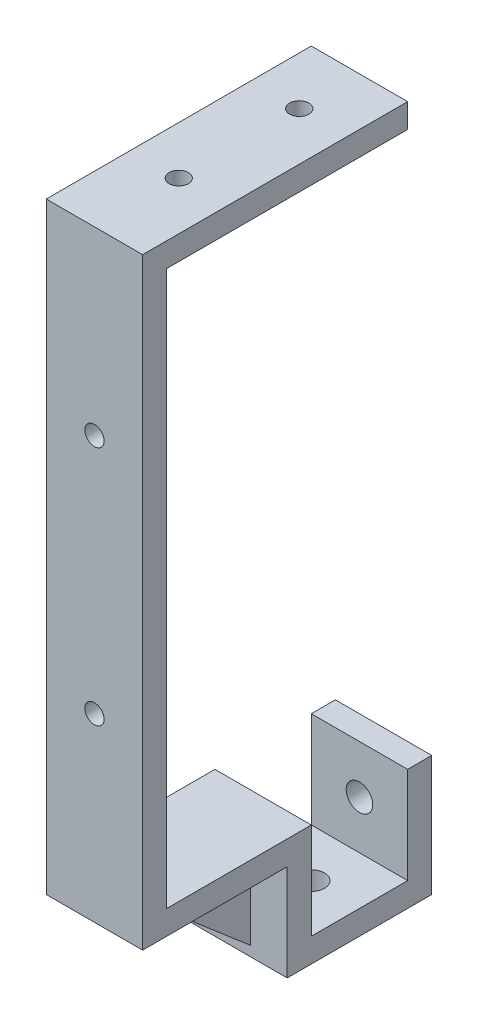
ISO-10303-21;
HEADER;
FILE_DESCRIPTION(('STEP AP214'),'2;1');
FILE_NAME('part.step','',(''),(''),'','','');
FILE_SCHEMA(('AUTOMOTIVE_DESIGN { 1 0 10303 214 1 1 1 1 }'));
ENDSEC;
DATA;
#1=APPLICATION_CONTEXT('core data for automotive mechanical design processes');
#2=APPLICATION_PROTOCOL_DEFINITION('international standard','automotive_design',2000,#1);
#3=PRODUCT_CONTEXT('',#1,'mechanical');
#4=PRODUCT('Part','Part','',(#3));
#5=PRODUCT_RELATED_PRODUCT_CATEGORY('part','',(#4));
#6=PRODUCT_DEFINITION_FORMATION('','',#4);
#7=PRODUCT_DEFINITION_CONTEXT('part definition',#1,'design');
#8=PRODUCT_DEFINITION('design','',#6,#7);
#9=PRODUCT_DEFINITION_SHAPE('','',#8);
#10=(LENGTH_UNIT() NAMED_UNIT(*) SI_UNIT(.MILLI.,.METRE.));
#11=(NAMED_UNIT(*) PLANE_ANGLE_UNIT() SI_UNIT($,.RADIAN.));
#12=(NAMED_UNIT(*) SI_UNIT($,.STERADIAN.) SOLID_ANGLE_UNIT());
#13=UNCERTAINTY_MEASURE_WITH_UNIT(LENGTH_MEASURE(1.E-05),#10,'distance_accuracy_value','');
#14=(GEOMETRIC_REPRESENTATION_CONTEXT(3) GLOBAL_UNCERTAINTY_ASSIGNED_CONTEXT((#13)) GLOBAL_UNIT_ASSIGNED_CONTEXT((#10,
#11,#12)) REPRESENTATION_CONTEXT('',''));
#15=CARTESIAN_POINT('',(0.,0.,0.));
#16=DIRECTION('',(0.,0.,1.));
#17=DIRECTION('',(1.,0.,0.));
#18=AXIS2_PLACEMENT_3D('',#15,#16,#17);
#19=CARTESIAN_POINT('',(-9.82905982905984,-125.128205128205,-55.));
#20=DIRECTION('',(0.,-1.,0.));
#21=DIRECTION('',(0.,0.,-1.));
#22=AXIS2_PLACEMENT_3D('',#19,#20,#21);
#23=PLANE('',#22);
#24=CARTESIAN_POINT('',(0.170940170940168,-125.128205128205,-45.));
#25=DIRECTION('',(0.,1.,0.));
#26=DIRECTION('',(0.,0.,1.));
#27=AXIS2_PLACEMENT_3D('',#24,#25,#26);
#28=CIRCLE('',#27,2.75);
#29=CARTESIAN_POINT('',(0.170940170940168,-125.128205128205,-42.25));
#30=VERTEX_POINT('',#29);
#31=EDGE_CURVE('E170',#30,#30,#28,.T.);
#32=ORIENTED_EDGE('',*,*,#31,.F.);
#33=EDGE_LOOP('',(#32));
#34=FACE_BOUND('',#33,.T.);
#35=DIRECTION('',(1.,0.,0.));
#36=VECTOR('',#35,1.);
#37=CARTESIAN_POINT('',(10.1709401709402,-125.128205128205,-55.));
#38=LINE('',#37,#36);
#39=CARTESIAN_POINT('',(-9.82905982905984,-125.128205128205,-55.));
#40=VERTEX_POINT('',#39);
#41=CARTESIAN_POINT('',(10.1709401709402,-125.128205128205,-55.));
#42=VERTEX_POINT('',#41);
#43=EDGE_CURVE('E187',#40,#42,#38,.T.);
#44=ORIENTED_EDGE('',*,*,#43,.F.);
#45=DIRECTION('',(0.,0.,1.));
#46=VECTOR('',#45,1.);
#47=CARTESIAN_POINT('',(-9.82905982905984,-125.128205128205,-55.));
#48=LINE('',#47,#46);
#49=CARTESIAN_POINT('',(-9.82905982905984,-125.128205128205,-35.));
#50=VERTEX_POINT('',#49);
#51=EDGE_CURVE('E273',#40,#50,#48,.T.);
#52=ORIENTED_EDGE('',*,*,#51,.T.);
#53=DIRECTION('',(1.,0.,0.));
#54=VECTOR('',#53,1.);
#55=CARTESIAN_POINT('',(-9.82905982905984,-125.128205128205,-35.));
#56=LINE('',#55,#54);
#57=CARTESIAN_POINT('',(10.1709401709402,-125.128205128205,-35.));
#58=VERTEX_POINT('',#57);
#59=EDGE_CURVE('E266',#50,#58,#56,.T.);
#60=ORIENTED_EDGE('',*,*,#59,.T.);
#61=DIRECTION('',(0.,0.,1.));
#62=VECTOR('',#61,1.);
#63=CARTESIAN_POINT('',(10.1709401709402,-125.128205128205,-55.));
#64=LINE('',#63,#62);
#65=EDGE_CURVE('E270',#42,#58,#64,.T.);
#66=ORIENTED_EDGE('',*,*,#65,.F.);
#67=EDGE_LOOP('',(#44,#52,#60,#66));
#68=FACE_BOUND('',#67,.T.);
#69=ADVANCED_FACE('F37',(#34,#68),#23,.F.);
#70=CARTESIAN_POINT('',(10.1709401709402,-110.128205128205,-35.));
#71=DIRECTION('',(0.,1.,0.));
#72=DIRECTION('',(0.,0.,1.));
#73=AXIS2_PLACEMENT_3D('',#70,#71,#72);
#74=PLANE('',#73);
#75=DIRECTION('',(-1.,0.,0.));
#76=VECTOR('',#75,1.);
#77=CARTESIAN_POINT('',(10.1709401709402,-110.128205128205,-30.));
#78=LINE('',#77,#76);
#79=CARTESIAN_POINT('',(10.1709401709402,-110.128205128205,-30.));
#80=VERTEX_POINT('',#79);
#81=CARTESIAN_POINT('',(-9.82905982905984,-110.128205128205,-30.));
#82=VERTEX_POINT('',#81);
#83=EDGE_CURVE('E61',#80,#82,#78,.T.);
#84=ORIENTED_EDGE('',*,*,#83,.F.);
#85=DIRECTION('',(0.,0.,1.));
#86=VECTOR('',#85,1.);
#87=CARTESIAN_POINT('',(10.1709401709402,-110.128205128205,-35.));
#88=LINE('',#87,#86);
#89=CARTESIAN_POINT('',(10.1709401709402,-110.128205128205,0.));
#90=VERTEX_POINT('',#89);
#91=EDGE_CURVE('E317',#80,#90,#88,.T.);
#92=ORIENTED_EDGE('',*,*,#91,.T.);
#93=DIRECTION('',(-1.,0.,0.));
#94=VECTOR('',#93,1.);
#95=CARTESIAN_POINT('',(0.,-110.128205128205,0.));
#96=LINE('',#95,#94);
#97=CARTESIAN_POINT('',(-9.82905982905984,-110.128205128205,0.));
#98=VERTEX_POINT('',#97);
#99=EDGE_CURVE('E369',#90,#98,#96,.T.);
#100=ORIENTED_EDGE('',*,*,#99,.T.);
#101=DIRECTION('',(0.,0.,1.));
#102=VECTOR('',#101,1.);
#103=CARTESIAN_POINT('',(-9.82905982905984,-110.128205128205,-35.));
#104=LINE('',#103,#102);
#105=EDGE_CURVE('E314',#82,#98,#104,.T.);
#106=ORIENTED_EDGE('',*,*,#105,.F.);
#107=EDGE_LOOP('',(#84,#92,#100,#106));
#108=FACE_BOUND('',#107,.T.);
#109=DIRECTION('',(0.,0.,1.));
#110=VECTOR('',#109,1.);
#111=CARTESIAN_POINT('',(2.67094017094017,-110.128205128205,-35.));
#112=LINE('',#111,#110);
#113=CARTESIAN_POINT('',(2.67094017094017,-110.128205128205,-29.9291696383079));
#114=VERTEX_POINT('',#113);
#115=CARTESIAN_POINT('',(2.67094017094017,-110.128205128205,-9.07177753676453));
#116=VERTEX_POINT('',#115);
#117=EDGE_CURVE('E11',#114,#116,#112,.T.);
#118=ORIENTED_EDGE('',*,*,#117,.F.);
#119=DIRECTION('',(1.,0.,0.));
#120=VECTOR('',#119,1.);
#121=CARTESIAN_POINT('',(10.1709401709402,-110.128205128205,-29.9291696383079));
#122=LINE('',#121,#120);
#123=CARTESIAN_POINT('',(-2.32905982905983,-110.128205128205,-29.9291696383079));
#124=VERTEX_POINT('',#123);
#125=EDGE_CURVE('E380',#124,#114,#122,.T.);
#126=ORIENTED_EDGE('',*,*,#125,.F.);
#127=DIRECTION('',(0.,0.,1.));
#128=VECTOR('',#127,1.);
#129=CARTESIAN_POINT('',(-2.32905982905983,-110.128205128205,-35.));
#130=LINE('',#129,#128);
#131=CARTESIAN_POINT('',(-2.32905982905983,-110.128205128205,-9.07177753676453));
#132=VERTEX_POINT('',#131);
#133=EDGE_CURVE('E376',#124,#132,#130,.T.);
#134=ORIENTED_EDGE('',*,*,#133,.T.);
#135=DIRECTION('',(-1.,0.,0.));
#136=VECTOR('',#135,1.);
#137=CARTESIAN_POINT('',(10.1709401709402,-110.128205128205,-9.07177753676454));
#138=LINE('',#137,#136);
#139=EDGE_CURVE('E46',#116,#132,#138,.T.);
#140=ORIENTED_EDGE('',*,*,#139,.F.);
#141=EDGE_LOOP('',(#118,#126,#134,#140));
#142=FACE_BOUND('',#141,.T.);
#143=ADVANCED_FACE('F391',(#108,#142),#74,.F.);
#144=CARTESIAN_POINT('',(0.,0.,-35.));
#145=DIRECTION('',(0.,0.,-1.));
#146=DIRECTION('',(-1.,0.,0.));
#147=AXIS2_PLACEMENT_3D('',#144,#145,#146);
#148=PLANE('',#147);
#149=DIRECTION('',(0.,-1.,0.));
#150=VECTOR('',#149,1.);
#151=CARTESIAN_POINT('',(10.1709401709402,-105.128205128205,-35.));
#152=LINE('',#151,#150);
#153=CARTESIAN_POINT('',(10.1709401709402,-105.128205128205,-35.));
#154=VERTEX_POINT('',#153);
#155=EDGE_CURVE('E295',#154,#58,#152,.T.);
#156=ORIENTED_EDGE('',*,*,#155,.T.);
#157=ORIENTED_EDGE('',*,*,#59,.F.);
#158=DIRECTION('',(0.,1.,0.));
#159=VECTOR('',#158,1.);
#160=CARTESIAN_POINT('',(-9.82905982905984,-110.128205128205,-35.));
#161=LINE('',#160,#159);
#162=CARTESIAN_POINT('',(-9.82905982905984,-105.128205128205,-35.));
#163=VERTEX_POINT('',#162);
#164=EDGE_CURVE('E299',#50,#163,#161,.T.);
#165=ORIENTED_EDGE('',*,*,#164,.T.);
#166=DIRECTION('',(1.,0.,0.));
#167=VECTOR('',#166,1.);
#168=CARTESIAN_POINT('',(10.1709401709402,-105.128205128205,-35.));
#169=LINE('',#168,#167);
#170=EDGE_CURVE('E302',#163,#154,#169,.T.);
#171=ORIENTED_EDGE('',*,*,#170,.T.);
#172=EDGE_LOOP('',(#156,#157,#165,#171));
#173=FACE_BOUND('',#172,.T.);
#174=ADVANCED_FACE('F414',(#173),#148,.T.);
#175=CARTESIAN_POINT('',(0.,0.,-5.));
#176=DIRECTION('',(0.,0.,1.));
#177=DIRECTION('',(1.,0.,0.));
#178=AXIS2_PLACEMENT_3D('',#175,#176,#177);
#179=PLANE('',#178);
#180=CARTESIAN_POINT('',(0.170940170940166,-22.6282051282051,-5.));
#181=DIRECTION('',(0.,0.,-1.));
#182=DIRECTION('',(-1.,0.,0.));
#183=AXIS2_PLACEMENT_3D('',#180,#181,#182);
#184=CIRCLE('',#183,2.);
#185=CARTESIAN_POINT('',(-1.82905982905983,-22.6282051282051,-5.));
#186=VERTEX_POINT('',#185);
#187=EDGE_CURVE('E223',#186,#186,#184,.T.);
#188=ORIENTED_EDGE('',*,*,#187,.F.);
#189=EDGE_LOOP('',(#188));
#190=FACE_BOUND('',#189,.T.);
#191=CARTESIAN_POINT('',(0.170940170940166,-72.6282051282051,-5.));
#192=DIRECTION('',(0.,0.,-1.));
#193=DIRECTION('',(-1.,0.,0.));
#194=AXIS2_PLACEMENT_3D('',#191,#192,#193);
#195=CIRCLE('',#194,2.);
#196=CARTESIAN_POINT('',(-1.82905982905983,-72.6282051282051,-5.));
#197=VERTEX_POINT('',#196);
#198=EDGE_CURVE('E214',#197,#197,#195,.T.);
#199=ORIENTED_EDGE('',*,*,#198,.F.);
#200=EDGE_LOOP('',(#199));
#201=FACE_BOUND('',#200,.T.);
#202=DIRECTION('',(1.,0.,0.));
#203=VECTOR('',#202,1.);
#204=CARTESIAN_POINT('',(10.1709401709402,-105.128205128205,-5.));
#205=LINE('',#204,#203);
#206=CARTESIAN_POINT('',(-9.82905982905984,-105.128205128205,-5.));
#207=VERTEX_POINT('',#206);
#208=CARTESIAN_POINT('',(10.1709401709402,-105.128205128205,-5.));
#209=VERTEX_POINT('',#208);
#210=EDGE_CURVE('E294',#207,#209,#205,.T.);
#211=ORIENTED_EDGE('',*,*,#210,.F.);
#212=DIRECTION('',(0.,-1.,0.));
#213=VECTOR('',#212,1.);
#214=CARTESIAN_POINT('',(-9.82905982905984,14.8717948717949,-5.));
#215=LINE('',#214,#213);
#216=CARTESIAN_POINT('',(-9.82905982905984,9.87179487179487,-5.));
#217=VERTEX_POINT('',#216);
#218=EDGE_CURVE('E348',#217,#207,#215,.T.);
#219=ORIENTED_EDGE('',*,*,#218,.F.);
#220=DIRECTION('',(-1.,0.,0.));
#221=VECTOR('',#220,1.);
#222=CARTESIAN_POINT('',(10.1709401709402,9.87179487179488,-5.));
#223=LINE('',#222,#221);
#224=CARTESIAN_POINT('',(10.1709401709402,9.87179487179487,-5.));
#225=VERTEX_POINT('',#224);
#226=EDGE_CURVE('E320',#225,#217,#223,.T.);
#227=ORIENTED_EDGE('',*,*,#226,.F.);
#228=DIRECTION('',(0.,1.,0.));
#229=VECTOR('',#228,1.);
#230=CARTESIAN_POINT('',(10.1709401709402,14.8717948717949,-5.));
#231=LINE('',#230,#229);
#232=EDGE_CURVE('E352',#209,#225,#231,.T.);
#233=ORIENTED_EDGE('',*,*,#232,.F.);
#234=EDGE_LOOP('',(#211,#219,#227,#233));
#235=FACE_BOUND('',#234,.T.);
#236=ADVANCED_FACE('F431',(#190,#201,#235),#179,.F.);
#237=CARTESIAN_POINT('',(-9.82905982905984,14.8717948717949,-5.));
#238=DIRECTION('',(-1.,0.,0.));
#239=DIRECTION('',(0.,-1.,0.));
#240=AXIS2_PLACEMENT_3D('',#237,#238,#239);
#241=PLANE('',#240);
#242=ORIENTED_EDGE('',*,*,#164,.F.);
#243=ORIENTED_EDGE('',*,*,#51,.F.);
#244=DIRECTION('',(0.,-1.,0.));
#245=VECTOR('',#244,1.);
#246=CARTESIAN_POINT('',(-9.82905982905984,-105.128205128205,-55.));
#247=LINE('',#246,#245);
#248=CARTESIAN_POINT('',(-9.82905982905984,-105.128205128205,-55.));
#249=VERTEX_POINT('',#248);
#250=EDGE_CURVE('E202',#249,#40,#247,.T.);
#251=ORIENTED_EDGE('',*,*,#250,.F.);
#252=DIRECTION('',(0.,0.,1.));
#253=VECTOR('',#252,1.);
#254=CARTESIAN_POINT('',(-9.82905982905984,-105.128205128205,-60.));
#255=LINE('',#254,#253);
#256=CARTESIAN_POINT('',(-9.82905982905984,-105.128205128205,-60.));
#257=VERTEX_POINT('',#256);
#258=EDGE_CURVE('E180',#257,#249,#255,.T.);
#259=ORIENTED_EDGE('',*,*,#258,.F.);
#260=DIRECTION('',(0.,1.,0.));
#261=VECTOR('',#260,1.);
#262=CARTESIAN_POINT('',(-9.82905982905984,-130.128205128205,-60.));
#263=LINE('',#262,#261);
#264=CARTESIAN_POINT('',(-9.82905982905984,-130.128205128205,-60.));
#265=VERTEX_POINT('',#264);
#266=EDGE_CURVE('E171',#265,#257,#263,.T.);
#267=ORIENTED_EDGE('',*,*,#266,.F.);
#268=DIRECTION('',(0.,0.,-1.));
#269=VECTOR('',#268,1.);
#270=CARTESIAN_POINT('',(-9.82905982905984,-130.128205128205,-35.));
#271=LINE('',#270,#269);
#272=CARTESIAN_POINT('',(-9.82905982905984,-130.128205128205,-30.));
#273=VERTEX_POINT('',#272);
#274=EDGE_CURVE('E281',#273,#265,#271,.T.);
#275=ORIENTED_EDGE('',*,*,#274,.F.);
#276=DIRECTION('',(0.,1.,0.));
#277=VECTOR('',#276,1.);
#278=CARTESIAN_POINT('',(-9.82905982905984,-130.128205128205,-30.));
#279=LINE('',#278,#277);
#280=EDGE_CURVE('E284',#273,#82,#279,.T.);
#281=ORIENTED_EDGE('',*,*,#280,.T.);
#282=ORIENTED_EDGE('',*,*,#105,.T.);
#283=DIRECTION('',(0.,-1.,0.));
#284=VECTOR('',#283,1.);
#285=CARTESIAN_POINT('',(-9.82905982905984,14.8717948717949,0.));
#286=LINE('',#285,#284);
#287=CARTESIAN_POINT('',(-9.82905982905984,14.8717948717949,0.));
#288=VERTEX_POINT('',#287);
#289=EDGE_CURVE('E347',#288,#98,#286,.T.);
#290=ORIENTED_EDGE('',*,*,#289,.F.);
#291=DIRECTION('',(0.,0.,1.));
#292=VECTOR('',#291,1.);
#293=CARTESIAN_POINT('',(-9.82905982905984,14.8717948717949,-5.));
#294=LINE('',#293,#292);
#295=CARTESIAN_POINT('',(-9.82905982905984,14.8717948717949,-55.));
#296=VERTEX_POINT('',#295);
#297=EDGE_CURVE('E366',#296,#288,#294,.T.);
#298=ORIENTED_EDGE('',*,*,#297,.F.);
#299=DIRECTION('',(0.,1.,0.));
#300=VECTOR('',#299,1.);
#301=CARTESIAN_POINT('',(-9.82905982905984,14.8717948717949,-55.));
#302=LINE('',#301,#300);
#303=CARTESIAN_POINT('',(-9.82905982905984,9.87179487179487,-55.));
#304=VERTEX_POINT('',#303);
#305=EDGE_CURVE('E328',#304,#296,#302,.T.);
#306=ORIENTED_EDGE('',*,*,#305,.F.);
#307=DIRECTION('',(0.,0.,1.));
#308=VECTOR('',#307,1.);
#309=CARTESIAN_POINT('',(-9.82905982905984,9.87179487179487,-55.));
#310=LINE('',#309,#308);
#311=EDGE_CURVE('E336',#304,#217,#310,.T.);
#312=ORIENTED_EDGE('',*,*,#311,.T.);
#313=ORIENTED_EDGE('',*,*,#218,.T.);
#314=DIRECTION('',(0.,0.,1.));
#315=VECTOR('',#314,1.);
#316=CARTESIAN_POINT('',(-9.82905982905984,-105.128205128205,-35.));
#317=LINE('',#316,#315);
#318=EDGE_CURVE('E311',#163,#207,#317,.T.);
#319=ORIENTED_EDGE('',*,*,#318,.F.);
#320=EDGE_LOOP('',(#242,#243,#251,#259,#267,#275,#281,#282,#290,#298,#306,#312,#313,#319));
#321=FACE_BOUND('',#320,.T.);
#322=ADVANCED_FACE('F39',(#321),#241,.T.);
#323=CARTESIAN_POINT('',(-9.82905982905984,14.8717948717949,-5.));
#324=DIRECTION('',(0.,1.,0.));
#325=DIRECTION('',(0.,0.,1.));
#326=AXIS2_PLACEMENT_3D('',#323,#324,#325);
#327=PLANE('',#326);
#328=CARTESIAN_POINT('',(0.170940170940157,14.8717948717949,-17.5));
#329=DIRECTION('',(0.,-1.,0.));
#330=DIRECTION('',(1.,0.,0.));
#331=AXIS2_PLACEMENT_3D('',#328,#329,#330);
#332=CIRCLE('',#331,2.);
#333=CARTESIAN_POINT('',(2.17094017094016,14.8717948717949,-17.5));
#334=VERTEX_POINT('',#333);
#335=EDGE_CURVE('E234',#334,#334,#332,.T.);
#336=ORIENTED_EDGE('',*,*,#335,.T.);
#337=EDGE_LOOP('',(#336));
#338=FACE_BOUND('',#337,.T.);
#339=CARTESIAN_POINT('',(0.170940170940164,14.8717948717949,-42.5));
#340=DIRECTION('',(0.,-1.,0.));
#341=DIRECTION('',(1.,0.,0.));
#342=AXIS2_PLACEMENT_3D('',#339,#340,#341);
#343=CIRCLE('',#342,2.);
#344=CARTESIAN_POINT('',(2.17094017094016,14.8717948717949,-42.5));
#345=VERTEX_POINT('',#344);
#346=EDGE_CURVE('E242',#345,#345,#343,.T.);
#347=ORIENTED_EDGE('',*,*,#346,.T.);
#348=EDGE_LOOP('',(#347));
#349=FACE_BOUND('',#348,.T.);
#350=DIRECTION('',(-1.,0.,0.));
#351=VECTOR('',#350,1.);
#352=CARTESIAN_POINT('',(-9.82905982905984,14.8717948717949,0.));
#353=LINE('',#352,#351);
#354=CARTESIAN_POINT('',(10.1709401709402,14.8717948717949,0.));
#355=VERTEX_POINT('',#354);
#356=EDGE_CURVE('E353',#355,#288,#353,.T.);
#357=ORIENTED_EDGE('',*,*,#356,.F.);
#358=DIRECTION('',(0.,0.,1.));
#359=VECTOR('',#358,1.);
#360=CARTESIAN_POINT('',(10.1709401709402,14.8717948717949,-5.));
#361=LINE('',#360,#359);
#362=CARTESIAN_POINT('',(10.1709401709402,14.8717948717949,-55.));
#363=VERTEX_POINT('',#362);
#364=EDGE_CURVE('E356',#363,#355,#361,.T.);
#365=ORIENTED_EDGE('',*,*,#364,.F.);
#366=DIRECTION('',(1.,0.,0.));
#367=VECTOR('',#366,1.);
#368=CARTESIAN_POINT('',(10.1709401709402,14.8717948717949,-55.));
#369=LINE('',#368,#367);
#370=EDGE_CURVE('E332',#296,#363,#369,.T.);
#371=ORIENTED_EDGE('',*,*,#370,.F.);
#372=ORIENTED_EDGE('',*,*,#297,.T.);
#373=EDGE_LOOP('',(#357,#365,#371,#372));
#374=FACE_BOUND('',#373,.T.);
#375=ADVANCED_FACE('F451',(#338,#349,#374),#327,.T.);
#376=CARTESIAN_POINT('',(10.1709401709402,14.8717948717949,-5.));
#377=DIRECTION('',(1.,0.,0.));
#378=DIRECTION('',(0.,1.,0.));
#379=AXIS2_PLACEMENT_3D('',#376,#377,#378);
#380=PLANE('',#379);
#381=DIRECTION('',(0.,1.,0.));
#382=VECTOR('',#381,1.);
#383=CARTESIAN_POINT('',(10.1709401709402,14.8717948717949,0.));
#384=LINE('',#383,#382);
#385=EDGE_CURVE('E360',#90,#355,#384,.T.);
#386=ORIENTED_EDGE('',*,*,#385,.F.);
#387=ORIENTED_EDGE('',*,*,#91,.F.);
#388=DIRECTION('',(0.,1.,0.));
#389=VECTOR('',#388,1.);
#390=CARTESIAN_POINT('',(10.1709401709402,-130.128205128205,-30.));
#391=LINE('',#390,#389);
#392=CARTESIAN_POINT('',(10.1709401709402,-130.128205128205,-30.));
#393=VERTEX_POINT('',#392);
#394=EDGE_CURVE('E290',#393,#80,#391,.T.);
#395=ORIENTED_EDGE('',*,*,#394,.F.);
#396=DIRECTION('',(0.,0.,1.));
#397=VECTOR('',#396,1.);
#398=CARTESIAN_POINT('',(10.1709401709402,-130.128205128205,-30.));
#399=LINE('',#398,#397);
#400=CARTESIAN_POINT('',(10.1709401709402,-130.128205128205,-60.));
#401=VERTEX_POINT('',#400);
#402=EDGE_CURVE('E165',#401,#393,#399,.T.);
#403=ORIENTED_EDGE('',*,*,#402,.F.);
#404=DIRECTION('',(0.,-1.,0.));
#405=VECTOR('',#404,1.);
#406=CARTESIAN_POINT('',(10.1709401709402,-125.128205128205,-60.));
#407=LINE('',#406,#405);
#408=CARTESIAN_POINT('',(10.1709401709402,-105.128205128205,-60.));
#409=VERTEX_POINT('',#408);
#410=EDGE_CURVE('E156',#409,#401,#407,.T.);
#411=ORIENTED_EDGE('',*,*,#410,.F.);
#412=DIRECTION('',(0.,0.,-1.));
#413=VECTOR('',#412,1.);
#414=CARTESIAN_POINT('',(10.1709401709402,-105.128205128205,-55.));
#415=LINE('',#414,#413);
#416=CARTESIAN_POINT('',(10.1709401709402,-105.128205128205,-55.));
#417=VERTEX_POINT('',#416);
#418=EDGE_CURVE('E162',#417,#409,#415,.T.);
#419=ORIENTED_EDGE('',*,*,#418,.F.);
#420=DIRECTION('',(0.,-1.,0.));
#421=VECTOR('',#420,1.);
#422=CARTESIAN_POINT('',(10.1709401709402,-105.128205128205,-55.));
#423=LINE('',#422,#421);
#424=EDGE_CURVE('E198',#417,#42,#423,.T.);
#425=ORIENTED_EDGE('',*,*,#424,.T.);
#426=ORIENTED_EDGE('',*,*,#65,.T.);
#427=ORIENTED_EDGE('',*,*,#155,.F.);
#428=DIRECTION('',(0.,0.,1.));
#429=VECTOR('',#428,1.);
#430=CARTESIAN_POINT('',(10.1709401709402,-105.128205128205,-35.));
#431=LINE('',#430,#429);
#432=EDGE_CURVE('E305',#154,#209,#431,.T.);
#433=ORIENTED_EDGE('',*,*,#432,.T.);
#434=ORIENTED_EDGE('',*,*,#232,.T.);
#435=DIRECTION('',(0.,0.,1.));
#436=VECTOR('',#435,1.);
#437=CARTESIAN_POINT('',(10.1709401709402,9.87179487179488,-55.));
#438=LINE('',#437,#436);
#439=CARTESIAN_POINT('',(10.1709401709402,9.87179487179488,-55.));
#440=VERTEX_POINT('',#439);
#441=EDGE_CURVE('E343',#440,#225,#438,.T.);
#442=ORIENTED_EDGE('',*,*,#441,.F.);
#443=DIRECTION('',(0.,-1.,0.));
#444=VECTOR('',#443,1.);
#445=CARTESIAN_POINT('',(10.1709401709402,9.87179487179488,-55.));
#446=LINE('',#445,#444);
#447=EDGE_CURVE('E321',#363,#440,#446,.T.);
#448=ORIENTED_EDGE('',*,*,#447,.F.);
#449=ORIENTED_EDGE('',*,*,#364,.T.);
#450=EDGE_LOOP('',(#386,#387,#395,#403,#411,#419,#425,#426,#427,#433,#434,#442,#448,#449));
#451=FACE_BOUND('',#450,.T.);
#452=ADVANCED_FACE('F159',(#451),#380,.T.);
#453=CARTESIAN_POINT('',(0.,0.,0.));
#454=DIRECTION('',(0.,0.,1.));
#455=DIRECTION('',(1.,0.,0.));
#456=AXIS2_PLACEMENT_3D('',#453,#454,#455);
#457=PLANE('',#456);
#458=CARTESIAN_POINT('',(0.170940170940166,-22.6282051282051,0.));
#459=DIRECTION('',(0.,0.,-1.));
#460=DIRECTION('',(-1.,0.,0.));
#461=AXIS2_PLACEMENT_3D('',#458,#459,#460);
#462=CIRCLE('',#461,2.);
#463=CARTESIAN_POINT('',(-1.82905982905983,-22.6282051282051,0.));
#464=VERTEX_POINT('',#463);
#465=EDGE_CURVE('E218',#464,#464,#462,.T.);
#466=ORIENTED_EDGE('',*,*,#465,.T.);
#467=EDGE_LOOP('',(#466));
#468=FACE_BOUND('',#467,.T.);
#469=CARTESIAN_POINT('',(0.170940170940166,-72.6282051282051,0.));
#470=DIRECTION('',(0.,0.,-1.));
#471=DIRECTION('',(-1.,0.,0.));
#472=AXIS2_PLACEMENT_3D('',#469,#470,#471);
#473=CIRCLE('',#472,2.);
#474=CARTESIAN_POINT('',(-1.82905982905983,-72.6282051282051,0.));
#475=VERTEX_POINT('',#474);
#476=EDGE_CURVE('E227',#475,#475,#473,.T.);
#477=ORIENTED_EDGE('',*,*,#476,.T.);
#478=EDGE_LOOP('',(#477));
#479=FACE_BOUND('',#478,.T.);
#480=ORIENTED_EDGE('',*,*,#99,.F.);
#481=ORIENTED_EDGE('',*,*,#385,.T.);
#482=ORIENTED_EDGE('',*,*,#356,.T.);
#483=ORIENTED_EDGE('',*,*,#289,.T.);
#484=EDGE_LOOP('',(#480,#481,#482,#483));
#485=FACE_BOUND('',#484,.T.);
#486=ADVANCED_FACE('F443',(#468,#479,#485),#457,.T.);
#487=CARTESIAN_POINT('',(10.1709401709402,9.87179487179488,-55.));
#488=DIRECTION('',(0.,1.,0.));
#489=DIRECTION('',(-1.,0.,0.));
#490=AXIS2_PLACEMENT_3D('',#487,#488,#489);
#491=PLANE('',#490);
#492=CARTESIAN_POINT('',(0.170940170940159,9.87179487179487,-17.5));
#493=DIRECTION('',(0.,-1.,0.));
#494=DIRECTION('',(1.,0.,0.));
#495=AXIS2_PLACEMENT_3D('',#492,#493,#494);
#496=CIRCLE('',#495,2.);
#497=CARTESIAN_POINT('',(2.17094017094016,9.87179487179487,-17.5));
#498=VERTEX_POINT('',#497);
#499=EDGE_CURVE('E238',#498,#498,#496,.T.);
#500=ORIENTED_EDGE('',*,*,#499,.F.);
#501=EDGE_LOOP('',(#500));
#502=FACE_BOUND('',#501,.T.);
#503=CARTESIAN_POINT('',(0.170940170940166,9.87179487179487,-42.5));
#504=DIRECTION('',(0.,-1.,0.));
#505=DIRECTION('',(1.,0.,0.));
#506=AXIS2_PLACEMENT_3D('',#503,#504,#505);
#507=CIRCLE('',#506,2.);
#508=CARTESIAN_POINT('',(2.17094017094017,9.87179487179487,-42.5));
#509=VERTEX_POINT('',#508);
#510=EDGE_CURVE('E222',#509,#509,#507,.T.);
#511=ORIENTED_EDGE('',*,*,#510,.F.);
#512=EDGE_LOOP('',(#511));
#513=FACE_BOUND('',#512,.T.);
#514=ORIENTED_EDGE('',*,*,#226,.T.);
#515=ORIENTED_EDGE('',*,*,#311,.F.);
#516=DIRECTION('',(-1.,0.,0.));
#517=VECTOR('',#516,1.);
#518=CARTESIAN_POINT('',(10.1709401709402,9.87179487179488,-55.));
#519=LINE('',#518,#517);
#520=EDGE_CURVE('E325',#440,#304,#519,.T.);
#521=ORIENTED_EDGE('',*,*,#520,.F.);
#522=ORIENTED_EDGE('',*,*,#441,.T.);
#523=EDGE_LOOP('',(#514,#515,#521,#522));
#524=FACE_BOUND('',#523,.T.);
#525=ADVANCED_FACE('F439',(#502,#513,#524),#491,.F.);
#526=CARTESIAN_POINT('',(0.,0.,-55.));
#527=DIRECTION('',(0.,0.,1.));
#528=DIRECTION('',(1.,0.,0.));
#529=AXIS2_PLACEMENT_3D('',#526,#527,#528);
#530=PLANE('',#529);
#531=ORIENTED_EDGE('',*,*,#447,.T.);
#532=ORIENTED_EDGE('',*,*,#520,.T.);
#533=ORIENTED_EDGE('',*,*,#305,.T.);
#534=ORIENTED_EDGE('',*,*,#370,.T.);
#535=EDGE_LOOP('',(#531,#532,#533,#534));
#536=FACE_BOUND('',#535,.T.);
#537=ADVANCED_FACE('F434',(#536),#530,.F.);
#538=CARTESIAN_POINT('',(10.1709401709402,-105.128205128205,-35.));
#539=DIRECTION('',(0.,-1.,0.));
#540=DIRECTION('',(0.,0.,-1.));
#541=AXIS2_PLACEMENT_3D('',#538,#539,#540);
#542=PLANE('',#541);
#543=ORIENTED_EDGE('',*,*,#210,.T.);
#544=ORIENTED_EDGE('',*,*,#432,.F.);
#545=ORIENTED_EDGE('',*,*,#170,.F.);
#546=ORIENTED_EDGE('',*,*,#318,.T.);
#547=EDGE_LOOP('',(#543,#544,#545,#546));
#548=FACE_BOUND('',#547,.T.);
#549=ADVANCED_FACE('F427',(#548),#542,.F.);
#550=CARTESIAN_POINT('',(10.1709401709402,-130.128205128205,-30.));
#551=DIRECTION('',(0.,0.,-1.));
#552=DIRECTION('',(-1.,0.,0.));
#553=AXIS2_PLACEMENT_3D('',#550,#551,#552);
#554=PLANE('',#553);
#555=ORIENTED_EDGE('',*,*,#83,.T.);
#556=ORIENTED_EDGE('',*,*,#280,.F.);
#557=DIRECTION('',(-1.,0.,0.));
#558=VECTOR('',#557,1.);
#559=CARTESIAN_POINT('',(10.1709401709402,-130.128205128205,-30.));
#560=LINE('',#559,#558);
#561=EDGE_CURVE('E278',#393,#273,#560,.T.);
#562=ORIENTED_EDGE('',*,*,#561,.F.);
#563=ORIENTED_EDGE('',*,*,#394,.T.);
#564=EDGE_LOOP('',(#555,#556,#562,#563));
#565=FACE_BOUND('',#564,.T.);
#566=ADVANCED_FACE('F423',(#565),#554,.F.);
#567=CARTESIAN_POINT('',(0.,-130.128205128205,0.));
#568=DIRECTION('',(0.,1.,0.));
#569=DIRECTION('',(0.,0.,1.));
#570=AXIS2_PLACEMENT_3D('',#567,#568,#569);
#571=PLANE('',#570);
#572=CARTESIAN_POINT('',(0.170940170940168,-130.128205128205,-45.));
#573=DIRECTION('',(0.,1.,0.));
#574=DIRECTION('',(0.,0.,1.));
#575=AXIS2_PLACEMENT_3D('',#572,#573,#574);
#576=CIRCLE('',#575,2.75);
#577=CARTESIAN_POINT('',(0.170940170940168,-130.128205128205,-42.25));
#578=VERTEX_POINT('',#577);
#579=EDGE_CURVE('E210',#578,#578,#576,.T.);
#580=ORIENTED_EDGE('',*,*,#579,.T.);
#581=EDGE_LOOP('',(#580));
#582=FACE_BOUND('',#581,.T.);
#583=ORIENTED_EDGE('',*,*,#402,.T.);
#584=ORIENTED_EDGE('',*,*,#561,.T.);
#585=ORIENTED_EDGE('',*,*,#274,.T.);
#586=DIRECTION('',(-1.,0.,0.));
#587=VECTOR('',#586,1.);
#588=CARTESIAN_POINT('',(10.1709401709402,-130.128205128205,-60.));
#589=LINE('',#588,#587);
#590=EDGE_CURVE('E205',#401,#265,#589,.T.);
#591=ORIENTED_EDGE('',*,*,#590,.F.);
#592=EDGE_LOOP('',(#583,#584,#585,#591));
#593=FACE_BOUND('',#592,.T.);
#594=ADVANCED_FACE('F420',(#582,#593),#571,.F.);
#595=CARTESIAN_POINT('',(2.67094017094017,-110.036991645757,-8.9652738327004));
#596=DIRECTION('',(0.,0.759522254265013,-0.650481318160785));
#597=DIRECTION('',(0.,0.650481318160785,0.759522254265013));
#598=AXIS2_PLACEMENT_3D('',#595,#596,#597);
#599=PLANE('',#598);
#600=DIRECTION('',(0.,-0.650481318160785,-0.759522254265013));
#601=VECTOR('',#600,1.);
#602=CARTESIAN_POINT('',(2.67094017094017,-110.036991645757,-8.9652738327004));
#603=LINE('',#602,#601);
#604=CARTESIAN_POINT('',(2.67094017094017,-127.991202336545,-29.9291696383079));
#605=VERTEX_POINT('',#604);
#606=EDGE_CURVE('E249',#116,#605,#603,.T.);
#607=ORIENTED_EDGE('',*,*,#606,.F.);
#608=ORIENTED_EDGE('',*,*,#139,.T.);
#609=DIRECTION('',(0.,-0.650481318160785,-0.759522254265013));
#610=VECTOR('',#609,1.);
#611=CARTESIAN_POINT('',(-2.32905982905983,-110.036991645757,-8.9652738327004));
#612=LINE('',#611,#610);
#613=CARTESIAN_POINT('',(-2.32905982905983,-127.991202336545,-29.9291696383079));
#614=VERTEX_POINT('',#613);
#615=EDGE_CURVE('E53',#132,#614,#612,.T.);
#616=ORIENTED_EDGE('',*,*,#615,.T.);
#617=DIRECTION('',(-1.,0.,0.));
#618=VECTOR('',#617,1.);
#619=CARTESIAN_POINT('',(2.67094017094017,-127.991202336545,-29.9291696383079));
#620=LINE('',#619,#618);
#621=EDGE_CURVE('E257',#605,#614,#620,.T.);
#622=ORIENTED_EDGE('',*,*,#621,.F.);
#623=EDGE_LOOP('',(#607,#608,#616,#622));
#624=FACE_BOUND('',#623,.T.);
#625=ADVANCED_FACE('F386',(#624),#599,.F.);
#626=CARTESIAN_POINT('',(2.67094017094017,-127.991202336545,-29.9291696383079));
#627=DIRECTION('',(0.,0.,1.));
#628=DIRECTION('',(1.,0.,0.));
#629=AXIS2_PLACEMENT_3D('',#626,#627,#628);
#630=PLANE('',#629);
#631=DIRECTION('',(0.,1.,0.));
#632=VECTOR('',#631,1.);
#633=CARTESIAN_POINT('',(-2.32905982905983,-127.991202336545,-29.9291696383079));
#634=LINE('',#633,#632);
#635=EDGE_CURVE('E253',#614,#124,#634,.T.);
#636=ORIENTED_EDGE('',*,*,#635,.T.);
#637=ORIENTED_EDGE('',*,*,#125,.T.);
#638=DIRECTION('',(0.,1.,0.));
#639=VECTOR('',#638,1.);
#640=CARTESIAN_POINT('',(2.67094017094017,-127.991202336545,-29.9291696383079));
#641=LINE('',#640,#639);
#642=EDGE_CURVE('E252',#605,#114,#641,.T.);
#643=ORIENTED_EDGE('',*,*,#642,.F.);
#644=ORIENTED_EDGE('',*,*,#621,.T.);
#645=EDGE_LOOP('',(#636,#637,#643,#644));
#646=FACE_BOUND('',#645,.T.);
#647=ADVANCED_FACE('F394',(#646),#630,.F.);
#648=CARTESIAN_POINT('',(2.67094017094016,0.,0.));
#649=DIRECTION('',(-1.,0.,0.));
#650=DIRECTION('',(0.,-1.,0.));
#651=AXIS2_PLACEMENT_3D('',#648,#649,#650);
#652=PLANE('',#651);
#653=ORIENTED_EDGE('',*,*,#642,.T.);
#654=ORIENTED_EDGE('',*,*,#117,.T.);
#655=ORIENTED_EDGE('',*,*,#606,.T.);
#656=EDGE_LOOP('',(#653,#654,#655));
#657=FACE_BOUND('',#656,.T.);
#658=ADVANCED_FACE('F397',(#657),#652,.F.);
#659=CARTESIAN_POINT('',(-2.32905982905984,0.,0.));
#660=DIRECTION('',(-1.,0.,0.));
#661=DIRECTION('',(0.,-1.,0.));
#662=AXIS2_PLACEMENT_3D('',#659,#660,#661);
#663=PLANE('',#662);
#664=ORIENTED_EDGE('',*,*,#133,.F.);
#665=ORIENTED_EDGE('',*,*,#635,.F.);
#666=ORIENTED_EDGE('',*,*,#615,.F.);
#667=EDGE_LOOP('',(#664,#665,#666));
#668=FACE_BOUND('',#667,.T.);
#669=ADVANCED_FACE('F392',(#668),#663,.T.);
#670=CARTESIAN_POINT('',(0.170940170940164,14.8717948717949,-42.5));
#671=DIRECTION('',(0.,-1.,0.));
#672=DIRECTION('',(1.,0.,0.));
#673=AXIS2_PLACEMENT_3D('',#670,#671,#672);
#674=CYLINDRICAL_SURFACE('',#673,2.);
#675=ORIENTED_EDGE('',*,*,#346,.F.);
#676=EDGE_LOOP('',(#675));
#677=FACE_BOUND('',#676,.T.);
#678=ORIENTED_EDGE('',*,*,#510,.T.);
#679=EDGE_LOOP('',(#678));
#680=FACE_BOUND('',#679,.T.);
#681=ADVANCED_FACE('F404',(#677,#680),#674,.F.);
#682=CARTESIAN_POINT('',(0.170940170940157,14.8717948717949,-17.5));
#683=DIRECTION('',(0.,-1.,0.));
#684=DIRECTION('',(1.,0.,0.));
#685=AXIS2_PLACEMENT_3D('',#682,#683,#684);
#686=CYLINDRICAL_SURFACE('',#685,2.);
#687=ORIENTED_EDGE('',*,*,#335,.F.);
#688=EDGE_LOOP('',(#687));
#689=FACE_BOUND('',#688,.T.);
#690=ORIENTED_EDGE('',*,*,#499,.T.);
#691=EDGE_LOOP('',(#690));
#692=FACE_BOUND('',#691,.T.);
#693=ADVANCED_FACE('F648',(#689,#692),#686,.F.);
#694=CARTESIAN_POINT('',(0.170940170940166,-72.6282051282051,0.));
#695=DIRECTION('',(0.,0.,-1.));
#696=DIRECTION('',(-1.,0.,0.));
#697=AXIS2_PLACEMENT_3D('',#694,#695,#696);
#698=CYLINDRICAL_SURFACE('',#697,2.);
#699=ORIENTED_EDGE('',*,*,#476,.F.);
#700=EDGE_LOOP('',(#699));
#701=FACE_BOUND('',#700,.T.);
#702=ORIENTED_EDGE('',*,*,#198,.T.);
#703=EDGE_LOOP('',(#702));
#704=FACE_BOUND('',#703,.T.);
#705=ADVANCED_FACE('F640',(#701,#704),#698,.F.);
#706=CARTESIAN_POINT('',(0.170940170940166,-22.6282051282051,0.));
#707=DIRECTION('',(0.,0.,-1.));
#708=DIRECTION('',(-1.,0.,0.));
#709=AXIS2_PLACEMENT_3D('',#706,#707,#708);
#710=CYLINDRICAL_SURFACE('',#709,2.);
#711=ORIENTED_EDGE('',*,*,#465,.F.);
#712=EDGE_LOOP('',(#711));
#713=FACE_BOUND('',#712,.T.);
#714=ORIENTED_EDGE('',*,*,#187,.T.);
#715=EDGE_LOOP('',(#714));
#716=FACE_BOUND('',#715,.T.);
#717=ADVANCED_FACE('F631',(#713,#716),#710,.F.);
#718=CARTESIAN_POINT('',(0.170940170940168,-130.128205128205,-45.));
#719=DIRECTION('',(0.,1.,0.));
#720=DIRECTION('',(0.,0.,1.));
#721=AXIS2_PLACEMENT_3D('',#718,#719,#720);
#722=CYLINDRICAL_SURFACE('',#721,2.75);
#723=ORIENTED_EDGE('',*,*,#579,.F.);
#724=EDGE_LOOP('',(#723));
#725=FACE_BOUND('',#724,.T.);
#726=ORIENTED_EDGE('',*,*,#31,.T.);
#727=EDGE_LOOP('',(#726));
#728=FACE_BOUND('',#727,.T.);
#729=ADVANCED_FACE('F611',(#725,#728),#722,.F.);
#730=CARTESIAN_POINT('',(0.,0.,-60.));
#731=DIRECTION('',(0.,0.,-1.));
#732=DIRECTION('',(-1.,0.,0.));
#733=AXIS2_PLACEMENT_3D('',#730,#731,#732);
#734=PLANE('',#733);
#735=CARTESIAN_POINT('',(0.170940170940168,-115.12820513,-60.));
#736=DIRECTION('',(0.,0.,-1.));
#737=DIRECTION('',(-1.,0.,0.));
#738=AXIS2_PLACEMENT_3D('',#735,#736,#737);
#739=CIRCLE('',#738,2.75);
#740=CARTESIAN_POINT('',(-2.57905982905983,-115.12820513,-60.));
#741=VERTEX_POINT('',#740);
#742=EDGE_CURVE('E190',#741,#741,#739,.T.);
#743=ORIENTED_EDGE('',*,*,#742,.F.);
#744=EDGE_LOOP('',(#743));
#745=FACE_BOUND('',#744,.T.);
#746=ORIENTED_EDGE('',*,*,#590,.T.);
#747=ORIENTED_EDGE('',*,*,#266,.T.);
#748=DIRECTION('',(-1.,0.,0.));
#749=VECTOR('',#748,1.);
#750=CARTESIAN_POINT('',(10.1709401709402,-105.128205128205,-60.));
#751=LINE('',#750,#749);
#752=EDGE_CURVE('E174',#409,#257,#751,.T.);
#753=ORIENTED_EDGE('',*,*,#752,.F.);
#754=ORIENTED_EDGE('',*,*,#410,.T.);
#755=EDGE_LOOP('',(#746,#747,#753,#754));
#756=FACE_BOUND('',#755,.T.);
#757=ADVANCED_FACE('F175',(#745,#756),#734,.T.);
#758=CARTESIAN_POINT('',(10.1709401709402,-105.128205128205,-55.));
#759=DIRECTION('',(0.,0.,-1.));
#760=DIRECTION('',(-1.,0.,0.));
#761=AXIS2_PLACEMENT_3D('',#758,#759,#760);
#762=PLANE('',#761);
#763=CARTESIAN_POINT('',(0.170940170940168,-115.12820513,-55.));
#764=DIRECTION('',(0.,0.,1.));
#765=DIRECTION('',(1.,0.,0.));
#766=AXIS2_PLACEMENT_3D('',#763,#764,#765);
#767=CIRCLE('',#766,2.75);
#768=CARTESIAN_POINT('',(2.92094017094017,-115.12820513,-55.));
#769=VERTEX_POINT('',#768);
#770=EDGE_CURVE('E699',#769,#769,#767,.T.);
#771=ORIENTED_EDGE('',*,*,#770,.F.);
#772=EDGE_LOOP('',(#771));
#773=FACE_BOUND('',#772,.T.);
#774=ORIENTED_EDGE('',*,*,#43,.T.);
#775=ORIENTED_EDGE('',*,*,#424,.F.);
#776=DIRECTION('',(1.,0.,0.));
#777=VECTOR('',#776,1.);
#778=CARTESIAN_POINT('',(10.1709401709402,-105.128205128205,-55.));
#779=LINE('',#778,#777);
#780=EDGE_CURVE('E184',#249,#417,#779,.T.);
#781=ORIENTED_EDGE('',*,*,#780,.F.);
#782=ORIENTED_EDGE('',*,*,#250,.T.);
#783=EDGE_LOOP('',(#774,#775,#781,#782));
#784=FACE_BOUND('',#783,.T.);
#785=ADVANCED_FACE('F610',(#773,#784),#762,.F.);
#786=CARTESIAN_POINT('',(0.,-105.128205128205,0.));
#787=DIRECTION('',(0.,1.,0.));
#788=DIRECTION('',(0.,0.,1.));
#789=AXIS2_PLACEMENT_3D('',#786,#787,#788);
#790=PLANE('',#789);
#791=ORIENTED_EDGE('',*,*,#418,.T.);
#792=ORIENTED_EDGE('',*,*,#752,.T.);
#793=ORIENTED_EDGE('',*,*,#258,.T.);
#794=ORIENTED_EDGE('',*,*,#780,.T.);
#795=EDGE_LOOP('',(#791,#792,#793,#794));
#796=FACE_BOUND('',#795,.T.);
#797=ADVANCED_FACE('F182',(#796),#790,.T.);
#798=CARTESIAN_POINT('',(0.170940170940168,-115.12820513,-75.));
#799=DIRECTION('',(0.,0.,1.));
#800=DIRECTION('',(1.,0.,0.));
#801=AXIS2_PLACEMENT_3D('',#798,#799,#800);
#802=CYLINDRICAL_SURFACE('',#801,2.75);
#803=ORIENTED_EDGE('',*,*,#742,.T.);
#804=EDGE_LOOP('',(#803));
#805=FACE_BOUND('',#804,.T.);
#806=ORIENTED_EDGE('',*,*,#770,.T.);
#807=EDGE_LOOP('',(#806));
#808=FACE_BOUND('',#807,.T.);
#809=ADVANCED_FACE('F679',(#805,#808),#802,.F.);
#810=CLOSED_SHELL('',(#69,#143,#174,#236,#322,#375,#452,#486,#525,#537,#549,#566,#594,#625,#647,
#658,#669,#681,#693,#705,#717,#729,#757,#785,#797,#809));
#811=MANIFOLD_SOLID_BREP('B2',#810);
#812=ADVANCED_BREP_SHAPE_REPRESENTATION('',(#18,#811),#14);
#813=SHAPE_DEFINITION_REPRESENTATION(#9,#812);
ENDSEC;
END-ISO-10303-21;
